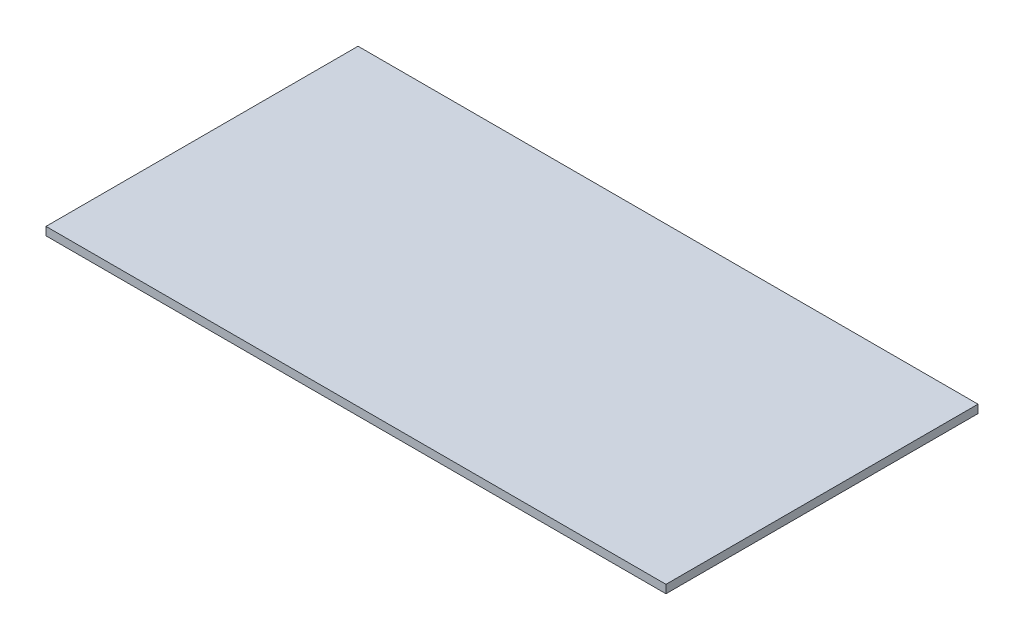
ISO-10303-21;
HEADER;
FILE_DESCRIPTION(('STEP AP214'),'2;1');
FILE_NAME('part.step','',(''),(''),'','','');
FILE_SCHEMA(('AUTOMOTIVE_DESIGN { 1 0 10303 214 1 1 1 1 }'));
ENDSEC;
DATA;
#1=APPLICATION_CONTEXT('core data for automotive mechanical design processes');
#2=APPLICATION_PROTOCOL_DEFINITION('international standard','automotive_design',2000,#1);
#3=PRODUCT_CONTEXT('',#1,'mechanical');
#4=PRODUCT('Part','Part','',(#3));
#5=PRODUCT_RELATED_PRODUCT_CATEGORY('part','',(#4));
#6=PRODUCT_DEFINITION_FORMATION('','',#4);
#7=PRODUCT_DEFINITION_CONTEXT('part definition',#1,'design');
#8=PRODUCT_DEFINITION('design','',#6,#7);
#9=PRODUCT_DEFINITION_SHAPE('','',#8);
#10=(LENGTH_UNIT() NAMED_UNIT(*) SI_UNIT(.MILLI.,.METRE.));
#11=(NAMED_UNIT(*) PLANE_ANGLE_UNIT() SI_UNIT($,.RADIAN.));
#12=(NAMED_UNIT(*) SI_UNIT($,.STERADIAN.) SOLID_ANGLE_UNIT());
#13=UNCERTAINTY_MEASURE_WITH_UNIT(LENGTH_MEASURE(1.E-05),#10,'distance_accuracy_value','');
#14=(GEOMETRIC_REPRESENTATION_CONTEXT(3) GLOBAL_UNCERTAINTY_ASSIGNED_CONTEXT((#13)) GLOBAL_UNIT_ASSIGNED_CONTEXT((#10,
#11,#12)) REPRESENTATION_CONTEXT('',''));
#15=CARTESIAN_POINT('',(0.,0.,0.));
#16=DIRECTION('',(0.,0.,1.));
#17=DIRECTION('',(1.,0.,0.));
#18=AXIS2_PLACEMENT_3D('',#15,#16,#17);
#19=CARTESIAN_POINT('',(89.9999999999998,49.,10.));
#20=DIRECTION('',(-1.,0.,0.));
#21=DIRECTION('',(0.,0.,1.));
#22=AXIS2_PLACEMENT_3D('',#19,#20,#21);
#23=PLANE('',#22);
#24=DIRECTION('',(0.,0.,1.));
#25=VECTOR('',#24,1.);
#26=CARTESIAN_POINT('',(89.9999999999998,50.,10.));
#27=LINE('',#26,#25);
#28=CARTESIAN_POINT('',(89.9999999999998,50.,10.));
#29=VERTEX_POINT('',#28);
#30=CARTESIAN_POINT('',(89.9999999999998,50.,45.));
#31=VERTEX_POINT('',#30);
#32=EDGE_CURVE('E127',#29,#31,#27,.T.);
#33=ORIENTED_EDGE('',*,*,#32,.F.);
#34=DIRECTION('',(0.,1.,0.));
#35=VECTOR('',#34,1.);
#36=CARTESIAN_POINT('',(89.9999999999998,49.,10.));
#37=LINE('',#36,#35);
#38=CARTESIAN_POINT('',(89.9999999999998,49.,10.));
#39=VERTEX_POINT('',#38);
#40=EDGE_CURVE('E11',#39,#29,#37,.T.);
#41=ORIENTED_EDGE('',*,*,#40,.F.);
#42=DIRECTION('',(0.,0.,1.));
#43=VECTOR('',#42,1.);
#44=CARTESIAN_POINT('',(89.9999999999998,49.,10.));
#45=LINE('',#44,#43);
#46=CARTESIAN_POINT('',(89.9999999999998,49.,45.));
#47=VERTEX_POINT('',#46);
#48=EDGE_CURVE('E136',#39,#47,#45,.T.);
#49=ORIENTED_EDGE('',*,*,#48,.T.);
#50=DIRECTION('',(0.,1.,0.));
#51=VECTOR('',#50,1.);
#52=CARTESIAN_POINT('',(89.9999999999998,49.,45.));
#53=LINE('',#52,#51);
#54=EDGE_CURVE('E35',#47,#31,#53,.T.);
#55=ORIENTED_EDGE('',*,*,#54,.T.);
#56=EDGE_LOOP('',(#33,#41,#49,#55));
#57=FACE_BOUND('',#56,.T.);
#58=ADVANCED_FACE('F32',(#57),#23,.T.);
#59=CARTESIAN_POINT('',(89.9999999999998,49.,10.));
#60=DIRECTION('',(0.,0.,-1.));
#61=DIRECTION('',(-1.,0.,0.));
#62=AXIS2_PLACEMENT_3D('',#59,#60,#61);
#63=PLANE('',#62);
#64=DIRECTION('',(-1.,0.,0.));
#65=VECTOR('',#64,1.);
#66=CARTESIAN_POINT('',(89.9999999999998,50.,10.));
#67=LINE('',#66,#65);
#68=CARTESIAN_POINT('',(162.5,50.,10.));
#69=VERTEX_POINT('',#68);
#70=EDGE_CURVE('E139',#69,#29,#67,.T.);
#71=ORIENTED_EDGE('',*,*,#70,.F.);
#72=DIRECTION('',(0.,1.,0.));
#73=VECTOR('',#72,1.);
#74=CARTESIAN_POINT('',(162.5,49.,10.));
#75=LINE('',#74,#73);
#76=CARTESIAN_POINT('',(162.5,49.,10.));
#77=VERTEX_POINT('',#76);
#78=EDGE_CURVE('E41',#77,#69,#75,.T.);
#79=ORIENTED_EDGE('',*,*,#78,.F.);
#80=DIRECTION('',(-1.,0.,0.));
#81=VECTOR('',#80,1.);
#82=CARTESIAN_POINT('',(89.9999999999998,49.,10.));
#83=LINE('',#82,#81);
#84=EDGE_CURVE('E143',#77,#39,#83,.T.);
#85=ORIENTED_EDGE('',*,*,#84,.T.);
#86=ORIENTED_EDGE('',*,*,#40,.T.);
#87=EDGE_LOOP('',(#71,#79,#85,#86));
#88=FACE_BOUND('',#87,.T.);
#89=ADVANCED_FACE('F157',(#88),#63,.T.);
#90=CARTESIAN_POINT('',(162.5,49.,10.));
#91=DIRECTION('',(1.,0.,0.));
#92=DIRECTION('',(0.,0.,-1.));
#93=AXIS2_PLACEMENT_3D('',#90,#91,#92);
#94=PLANE('',#93);
#95=DIRECTION('',(0.,0.,-1.));
#96=VECTOR('',#95,1.);
#97=CARTESIAN_POINT('',(162.5,50.,10.));
#98=LINE('',#97,#96);
#99=CARTESIAN_POINT('',(162.5,50.,45.));
#100=VERTEX_POINT('',#99);
#101=EDGE_CURVE('E148',#100,#69,#98,.T.);
#102=ORIENTED_EDGE('',*,*,#101,.F.);
#103=DIRECTION('',(0.,1.,0.));
#104=VECTOR('',#103,1.);
#105=CARTESIAN_POINT('',(162.5,49.,45.));
#106=LINE('',#105,#104);
#107=CARTESIAN_POINT('',(162.5,49.,45.));
#108=VERTEX_POINT('',#107);
#109=EDGE_CURVE('E64',#108,#100,#106,.T.);
#110=ORIENTED_EDGE('',*,*,#109,.F.);
#111=DIRECTION('',(0.,0.,-1.));
#112=VECTOR('',#111,1.);
#113=CARTESIAN_POINT('',(162.5,49.,10.));
#114=LINE('',#113,#112);
#115=EDGE_CURVE('E141',#108,#77,#114,.T.);
#116=ORIENTED_EDGE('',*,*,#115,.T.);
#117=ORIENTED_EDGE('',*,*,#78,.T.);
#118=EDGE_LOOP('',(#102,#110,#116,#117));
#119=FACE_BOUND('',#118,.T.);
#120=ADVANCED_FACE('F162',(#119),#94,.T.);
#121=CARTESIAN_POINT('',(89.9999999999998,49.,45.));
#122=DIRECTION('',(0.,0.,1.));
#123=DIRECTION('',(1.,0.,0.));
#124=AXIS2_PLACEMENT_3D('',#121,#122,#123);
#125=PLANE('',#124);
#126=DIRECTION('',(1.,0.,0.));
#127=VECTOR('',#126,1.);
#128=CARTESIAN_POINT('',(89.9999999999998,50.,45.));
#129=LINE('',#128,#127);
#130=EDGE_CURVE('E130',#31,#100,#129,.T.);
#131=ORIENTED_EDGE('',*,*,#130,.F.);
#132=ORIENTED_EDGE('',*,*,#54,.F.);
#133=DIRECTION('',(1.,0.,0.));
#134=VECTOR('',#133,1.);
#135=CARTESIAN_POINT('',(89.9999999999998,49.,45.));
#136=LINE('',#135,#134);
#137=EDGE_CURVE('E138',#47,#108,#136,.T.);
#138=ORIENTED_EDGE('',*,*,#137,.T.);
#139=ORIENTED_EDGE('',*,*,#109,.T.);
#140=EDGE_LOOP('',(#131,#132,#138,#139));
#141=FACE_BOUND('',#140,.T.);
#142=ADVANCED_FACE('F153',(#141),#125,.T.);
#143=CARTESIAN_POINT('',(0.,49.,0.));
#144=DIRECTION('',(0.,1.,0.));
#145=DIRECTION('',(0.,0.,1.));
#146=AXIS2_PLACEMENT_3D('',#143,#144,#145);
#147=PLANE('',#146);
#148=ORIENTED_EDGE('',*,*,#48,.F.);
#149=ORIENTED_EDGE('',*,*,#84,.F.);
#150=ORIENTED_EDGE('',*,*,#115,.F.);
#151=ORIENTED_EDGE('',*,*,#137,.F.);
#152=EDGE_LOOP('',(#148,#149,#150,#151));
#153=FACE_BOUND('',#152,.T.);
#154=ADVANCED_FACE('F161',(#153),#147,.F.);
#155=CARTESIAN_POINT('',(0.,50.,0.));
#156=DIRECTION('',(0.,1.,0.));
#157=DIRECTION('',(0.,0.,1.));
#158=AXIS2_PLACEMENT_3D('',#155,#156,#157);
#159=PLANE('',#158);
#160=DIRECTION('',(0.,0.,1.));
#161=VECTOR('',#160,1.);
#162=CARTESIAN_POINT('',(88.4999999999998,50.,8.5));
#163=LINE('',#162,#161);
#164=CARTESIAN_POINT('',(88.4999999999998,50.,8.5));
#165=VERTEX_POINT('',#164);
#166=CARTESIAN_POINT('',(88.4999999999998,50.,46.5));
#167=VERTEX_POINT('',#166);
#168=EDGE_CURVE('E126',#165,#167,#163,.T.);
#169=ORIENTED_EDGE('',*,*,#168,.F.);
#170=DIRECTION('',(-1.,0.,0.));
#171=VECTOR('',#170,1.);
#172=CARTESIAN_POINT('',(88.4999999999998,50.,8.5));
#173=LINE('',#172,#171);
#174=CARTESIAN_POINT('',(164.,50.,8.5));
#175=VERTEX_POINT('',#174);
#176=EDGE_CURVE('E122',#175,#165,#173,.T.);
#177=ORIENTED_EDGE('',*,*,#176,.F.);
#178=DIRECTION('',(0.,0.,-1.));
#179=VECTOR('',#178,1.);
#180=CARTESIAN_POINT('',(164.,50.,8.5));
#181=LINE('',#180,#179);
#182=CARTESIAN_POINT('',(164.,50.,46.5));
#183=VERTEX_POINT('',#182);
#184=EDGE_CURVE('E258',#183,#175,#181,.T.);
#185=ORIENTED_EDGE('',*,*,#184,.F.);
#186=DIRECTION('',(1.,0.,0.));
#187=VECTOR('',#186,1.);
#188=CARTESIAN_POINT('',(88.4999999999998,50.,46.5));
#189=LINE('',#188,#187);
#190=EDGE_CURVE('E261',#167,#183,#189,.T.);
#191=ORIENTED_EDGE('',*,*,#190,.F.);
#192=EDGE_LOOP('',(#169,#177,#185,#191));
#193=FACE_BOUND('',#192,.T.);
#194=ORIENTED_EDGE('',*,*,#70,.T.);
#195=ORIENTED_EDGE('',*,*,#32,.T.);
#196=ORIENTED_EDGE('',*,*,#130,.T.);
#197=ORIENTED_EDGE('',*,*,#101,.T.);
#198=EDGE_LOOP('',(#194,#195,#196,#197));
#199=FACE_BOUND('',#198,.T.);
#200=ADVANCED_FACE('F155',(#193,#199),#159,.F.);
#201=CARTESIAN_POINT('',(88.4999999999998,51.,8.5));
#202=DIRECTION('',(1.,0.,0.));
#203=DIRECTION('',(0.,0.,-1.));
#204=AXIS2_PLACEMENT_3D('',#201,#202,#203);
#205=PLANE('',#204);
#206=ORIENTED_EDGE('',*,*,#168,.T.);
#207=DIRECTION('',(0.,-1.,0.));
#208=VECTOR('',#207,1.);
#209=CARTESIAN_POINT('',(88.4999999999998,51.,46.5));
#210=LINE('',#209,#208);
#211=CARTESIAN_POINT('',(88.4999999999998,51.,46.5));
#212=VERTEX_POINT('',#211);
#213=EDGE_CURVE('E106',#212,#167,#210,.T.);
#214=ORIENTED_EDGE('',*,*,#213,.F.);
#215=DIRECTION('',(0.,0.,1.));
#216=VECTOR('',#215,1.);
#217=CARTESIAN_POINT('',(88.4999999999998,51.,8.5));
#218=LINE('',#217,#216);
#219=CARTESIAN_POINT('',(88.4999999999998,51.,8.5));
#220=VERTEX_POINT('',#219);
#221=EDGE_CURVE('E113',#220,#212,#218,.T.);
#222=ORIENTED_EDGE('',*,*,#221,.F.);
#223=DIRECTION('',(0.,-1.,0.));
#224=VECTOR('',#223,1.);
#225=CARTESIAN_POINT('',(88.4999999999998,51.,8.5));
#226=LINE('',#225,#224);
#227=EDGE_CURVE('E255',#220,#165,#226,.T.);
#228=ORIENTED_EDGE('',*,*,#227,.T.);
#229=EDGE_LOOP('',(#206,#214,#222,#228));
#230=FACE_BOUND('',#229,.T.);
#231=ADVANCED_FACE('F124',(#230),#205,.F.);
#232=CARTESIAN_POINT('',(88.4999999999998,51.,46.5));
#233=DIRECTION('',(0.,0.,-1.));
#234=DIRECTION('',(-1.,0.,0.));
#235=AXIS2_PLACEMENT_3D('',#232,#233,#234);
#236=PLANE('',#235);
#237=ORIENTED_EDGE('',*,*,#190,.T.);
#238=DIRECTION('',(0.,-1.,0.));
#239=VECTOR('',#238,1.);
#240=CARTESIAN_POINT('',(164.,51.,46.5));
#241=LINE('',#240,#239);
#242=CARTESIAN_POINT('',(164.,51.,46.5));
#243=VERTEX_POINT('',#242);
#244=EDGE_CURVE('E109',#243,#183,#241,.T.);
#245=ORIENTED_EDGE('',*,*,#244,.F.);
#246=DIRECTION('',(1.,0.,0.));
#247=VECTOR('',#246,1.);
#248=CARTESIAN_POINT('',(88.4999999999998,51.,46.5));
#249=LINE('',#248,#247);
#250=EDGE_CURVE('E102',#212,#243,#249,.T.);
#251=ORIENTED_EDGE('',*,*,#250,.F.);
#252=ORIENTED_EDGE('',*,*,#213,.T.);
#253=EDGE_LOOP('',(#237,#245,#251,#252));
#254=FACE_BOUND('',#253,.T.);
#255=ADVANCED_FACE('F104',(#254),#236,.F.);
#256=CARTESIAN_POINT('',(164.,51.,8.5));
#257=DIRECTION('',(-1.,0.,0.));
#258=DIRECTION('',(0.,0.,1.));
#259=AXIS2_PLACEMENT_3D('',#256,#257,#258);
#260=PLANE('',#259);
#261=ORIENTED_EDGE('',*,*,#184,.T.);
#262=DIRECTION('',(0.,-1.,0.));
#263=VECTOR('',#262,1.);
#264=CARTESIAN_POINT('',(164.,51.,8.5));
#265=LINE('',#264,#263);
#266=CARTESIAN_POINT('',(164.,51.,8.5));
#267=VERTEX_POINT('',#266);
#268=EDGE_CURVE('E132',#267,#175,#265,.T.);
#269=ORIENTED_EDGE('',*,*,#268,.F.);
#270=DIRECTION('',(0.,0.,-1.));
#271=VECTOR('',#270,1.);
#272=CARTESIAN_POINT('',(164.,51.,8.5));
#273=LINE('',#272,#271);
#274=EDGE_CURVE('E112',#243,#267,#273,.T.);
#275=ORIENTED_EDGE('',*,*,#274,.F.);
#276=ORIENTED_EDGE('',*,*,#244,.T.);
#277=EDGE_LOOP('',(#261,#269,#275,#276));
#278=FACE_BOUND('',#277,.T.);
#279=ADVANCED_FACE('F224',(#278),#260,.F.);
#280=CARTESIAN_POINT('',(88.4999999999998,51.,8.5));
#281=DIRECTION('',(0.,0.,1.));
#282=DIRECTION('',(1.,0.,0.));
#283=AXIS2_PLACEMENT_3D('',#280,#281,#282);
#284=PLANE('',#283);
#285=ORIENTED_EDGE('',*,*,#176,.T.);
#286=ORIENTED_EDGE('',*,*,#227,.F.);
#287=DIRECTION('',(-1.,0.,0.));
#288=VECTOR('',#287,1.);
#289=CARTESIAN_POINT('',(88.4999999999998,51.,8.5));
#290=LINE('',#289,#288);
#291=EDGE_CURVE('E118',#267,#220,#290,.T.);
#292=ORIENTED_EDGE('',*,*,#291,.F.);
#293=ORIENTED_EDGE('',*,*,#268,.T.);
#294=EDGE_LOOP('',(#285,#286,#292,#293));
#295=FACE_BOUND('',#294,.T.);
#296=ADVANCED_FACE('F233',(#295),#284,.F.);
#297=CARTESIAN_POINT('',(0.,51.,0.));
#298=DIRECTION('',(0.,1.,0.));
#299=DIRECTION('',(0.,0.,1.));
#300=AXIS2_PLACEMENT_3D('',#297,#298,#299);
#301=PLANE('',#300);
#302=ORIENTED_EDGE('',*,*,#221,.T.);
#303=ORIENTED_EDGE('',*,*,#250,.T.);
#304=ORIENTED_EDGE('',*,*,#274,.T.);
#305=ORIENTED_EDGE('',*,*,#291,.T.);
#306=EDGE_LOOP('',(#302,#303,#304,#305));
#307=FACE_BOUND('',#306,.T.);
#308=ADVANCED_FACE('F116',(#307),#301,.T.);
#309=CLOSED_SHELL('',(#58,#89,#120,#142,#154,#200,#231,#255,#279,#296,#308));
#310=MANIFOLD_SOLID_BREP('B2',#309);
#311=ADVANCED_BREP_SHAPE_REPRESENTATION('',(#18,#310),#14);
#312=SHAPE_DEFINITION_REPRESENTATION(#9,#311);
ENDSEC;
END-ISO-10303-21;
